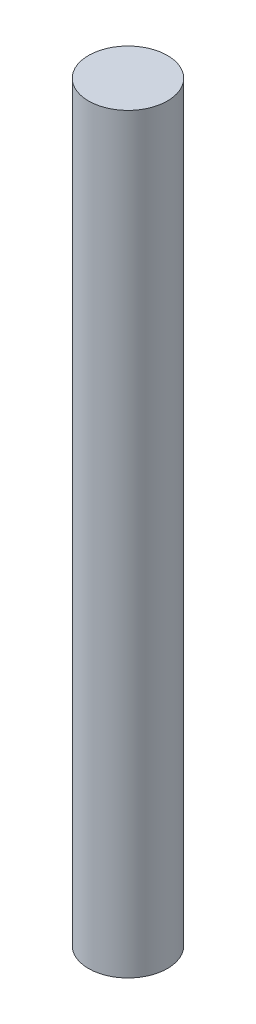
ISO-10303-21;
HEADER;
FILE_DESCRIPTION(('STEP AP214'),'2;1');
FILE_NAME('part.step','',(''),(''),'','','');
FILE_SCHEMA(('AUTOMOTIVE_DESIGN { 1 0 10303 214 1 1 1 1 }'));
ENDSEC;
DATA;
#1=APPLICATION_CONTEXT('core data for automotive mechanical design processes');
#2=APPLICATION_PROTOCOL_DEFINITION('international standard','automotive_design',2000,#1);
#3=PRODUCT_CONTEXT('',#1,'mechanical');
#4=PRODUCT('Part','Part','',(#3));
#5=PRODUCT_RELATED_PRODUCT_CATEGORY('part','',(#4));
#6=PRODUCT_DEFINITION_FORMATION('','',#4);
#7=PRODUCT_DEFINITION_CONTEXT('part definition',#1,'design');
#8=PRODUCT_DEFINITION('design','',#6,#7);
#9=PRODUCT_DEFINITION_SHAPE('','',#8);
#10=(LENGTH_UNIT() NAMED_UNIT(*) SI_UNIT(.MILLI.,.METRE.));
#11=(NAMED_UNIT(*) PLANE_ANGLE_UNIT() SI_UNIT($,.RADIAN.));
#12=(NAMED_UNIT(*) SI_UNIT($,.STERADIAN.) SOLID_ANGLE_UNIT());
#13=UNCERTAINTY_MEASURE_WITH_UNIT(LENGTH_MEASURE(1.E-05),#10,'distance_accuracy_value','');
#14=(GEOMETRIC_REPRESENTATION_CONTEXT(3) GLOBAL_UNCERTAINTY_ASSIGNED_CONTEXT((#13)) GLOBAL_UNIT_ASSIGNED_CONTEXT((#10,
#11,#12)) REPRESENTATION_CONTEXT('',''));
#15=CARTESIAN_POINT('',(0.,0.,0.));
#16=DIRECTION('',(0.,0.,1.));
#17=DIRECTION('',(1.,0.,0.));
#18=AXIS2_PLACEMENT_3D('',#15,#16,#17);
#19=CARTESIAN_POINT('',(0.,38.1,0.));
#20=DIRECTION('',(0.,-1.,0.));
#21=DIRECTION('',(0.,0.,-1.));
#22=AXIS2_PLACEMENT_3D('',#19,#20,#21);
#23=CYLINDRICAL_SURFACE('',#22,2.);
#24=CARTESIAN_POINT('',(0.,38.1,0.));
#25=DIRECTION('',(0.,1.,0.));
#26=DIRECTION('',(0.,0.,1.));
#27=AXIS2_PLACEMENT_3D('',#24,#25,#26);
#28=CIRCLE('',#27,2.);
#29=CARTESIAN_POINT('',(0.,38.1,2.));
#30=VERTEX_POINT('',#29);
#31=EDGE_CURVE('E10',#30,#30,#28,.T.);
#32=ORIENTED_EDGE('',*,*,#31,.F.);
#33=EDGE_LOOP('',(#32));
#34=FACE_BOUND('',#33,.T.);
#35=CARTESIAN_POINT('',(0.,0.,0.));
#36=DIRECTION('',(0.,1.,0.));
#37=DIRECTION('',(0.,0.,1.));
#38=AXIS2_PLACEMENT_3D('',#35,#36,#37);
#39=CIRCLE('',#38,2.);
#40=CARTESIAN_POINT('',(0.,0.,2.));
#41=VERTEX_POINT('',#40);
#42=EDGE_CURVE('E32',#41,#41,#39,.T.);
#43=ORIENTED_EDGE('',*,*,#42,.T.);
#44=EDGE_LOOP('',(#43));
#45=FACE_BOUND('',#44,.T.);
#46=ADVANCED_FACE('F29',(#34,#45),#23,.T.);
#47=CARTESIAN_POINT('',(0.,38.1,0.));
#48=DIRECTION('',(0.,1.,0.));
#49=DIRECTION('',(0.,0.,1.));
#50=AXIS2_PLACEMENT_3D('',#47,#48,#49);
#51=PLANE('',#50);
#52=ORIENTED_EDGE('',*,*,#31,.T.);
#53=EDGE_LOOP('',(#52));
#54=FACE_BOUND('',#53,.T.);
#55=ADVANCED_FACE('F44',(#54),#51,.T.);
#56=CARTESIAN_POINT('',(0.,0.,0.));
#57=DIRECTION('',(0.,1.,0.));
#58=DIRECTION('',(0.,0.,1.));
#59=AXIS2_PLACEMENT_3D('',#56,#57,#58);
#60=PLANE('',#59);
#61=ORIENTED_EDGE('',*,*,#42,.F.);
#62=EDGE_LOOP('',(#61));
#63=FACE_BOUND('',#62,.T.);
#64=ADVANCED_FACE('F42',(#63),#60,.F.);
#65=CLOSED_SHELL('',(#46,#55,#64));
#66=MANIFOLD_SOLID_BREP('B2',#65);
#67=ADVANCED_BREP_SHAPE_REPRESENTATION('',(#18,#66),#14);
#68=SHAPE_DEFINITION_REPRESENTATION(#9,#67);
ENDSEC;
END-ISO-10303-21;
